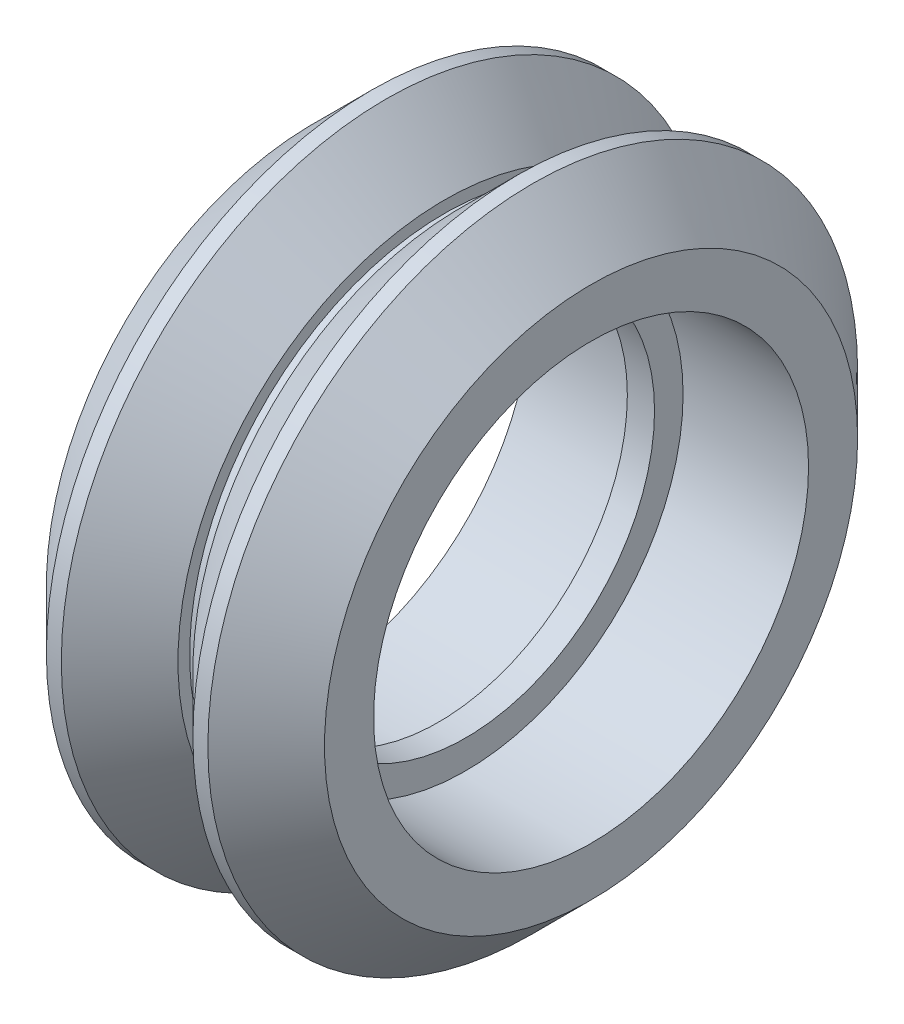
ISO-10303-21;
HEADER;
FILE_DESCRIPTION(('STEP AP214'),'2;1');
FILE_NAME('part.step','',(''),(''),'','','');
FILE_SCHEMA(('AUTOMOTIVE_DESIGN { 1 0 10303 214 1 1 1 1 }'));
ENDSEC;
DATA;
#1=APPLICATION_CONTEXT('core data for automotive mechanical design processes');
#2=APPLICATION_PROTOCOL_DEFINITION('international standard','automotive_design',2000,#1);
#3=PRODUCT_CONTEXT('',#1,'mechanical');
#4=PRODUCT('Part','Part','',(#3));
#5=PRODUCT_RELATED_PRODUCT_CATEGORY('part','',(#4));
#6=PRODUCT_DEFINITION_FORMATION('','',#4);
#7=PRODUCT_DEFINITION_CONTEXT('part definition',#1,'design');
#8=PRODUCT_DEFINITION('design','',#6,#7);
#9=PRODUCT_DEFINITION_SHAPE('','',#8);
#10=(LENGTH_UNIT() NAMED_UNIT(*) SI_UNIT(.MILLI.,.METRE.));
#11=(NAMED_UNIT(*) PLANE_ANGLE_UNIT() SI_UNIT($,.RADIAN.));
#12=(NAMED_UNIT(*) SI_UNIT($,.STERADIAN.) SOLID_ANGLE_UNIT());
#13=UNCERTAINTY_MEASURE_WITH_UNIT(LENGTH_MEASURE(1.E-05),#10,'distance_accuracy_value','');
#14=(GEOMETRIC_REPRESENTATION_CONTEXT(3) GLOBAL_UNCERTAINTY_ASSIGNED_CONTEXT((#13)) GLOBAL_UNIT_ASSIGNED_CONTEXT((#10,
#11,#12)) REPRESENTATION_CONTEXT('',''));
#15=CARTESIAN_POINT('',(0.,0.,0.));
#16=DIRECTION('',(0.,0.,1.));
#17=DIRECTION('',(1.,0.,0.));
#18=AXIS2_PLACEMENT_3D('',#15,#16,#17);
#19=CARTESIAN_POINT('',(-0.499999999999999,6.95,0.));
#20=DIRECTION('',(-1.,0.,0.));
#21=DIRECTION('',(0.,0.,1.));
#22=AXIS2_PLACEMENT_3D('',#19,#20,#21);
#23=PLANE('',#22);
#24=CARTESIAN_POINT('',(-0.499999999999999,0.,0.));
#25=DIRECTION('',(1.,0.,0.));
#26=DIRECTION('',(0.,0.,-1.));
#27=AXIS2_PLACEMENT_3D('',#24,#25,#26);
#28=CIRCLE('',#27,6.95);
#29=CARTESIAN_POINT('',(-0.499999999999999,0.,-6.95));
#30=VERTEX_POINT('',#29);
#31=EDGE_CURVE('E10',#30,#30,#28,.T.);
#32=ORIENTED_EDGE('',*,*,#31,.T.);
#33=EDGE_LOOP('',(#32));
#34=FACE_BOUND('',#33,.T.);
#35=CARTESIAN_POINT('',(-0.499999999999999,0.,0.));
#36=DIRECTION('',(1.,0.,0.));
#37=DIRECTION('',(0.,0.,-1.));
#38=AXIS2_PLACEMENT_3D('',#35,#36,#37);
#39=CIRCLE('',#38,8.);
#40=CARTESIAN_POINT('',(-0.499999999999999,0.,-8.));
#41=VERTEX_POINT('',#40);
#42=EDGE_CURVE('E89',#41,#41,#39,.T.);
#43=ORIENTED_EDGE('',*,*,#42,.F.);
#44=EDGE_LOOP('',(#43));
#45=FACE_BOUND('',#44,.T.);
#46=ADVANCED_FACE('F37',(#34,#45),#23,.T.);
#47=CARTESIAN_POINT('',(0.,0.,0.));
#48=DIRECTION('',(1.,0.,0.));
#49=DIRECTION('',(0.,0.,-1.));
#50=AXIS2_PLACEMENT_3D('',#47,#48,#49);
#51=CYLINDRICAL_SURFACE('',#50,6.95);
#52=CARTESIAN_POINT('',(0.500000000000001,0.,0.));
#53=DIRECTION('',(1.,0.,0.));
#54=DIRECTION('',(0.,0.,-1.));
#55=AXIS2_PLACEMENT_3D('',#52,#53,#54);
#56=CIRCLE('',#55,6.95);
#57=CARTESIAN_POINT('',(0.500000000000001,0.,-6.95));
#58=VERTEX_POINT('',#57);
#59=EDGE_CURVE('E43',#58,#58,#56,.T.);
#60=ORIENTED_EDGE('',*,*,#59,.T.);
#61=EDGE_LOOP('',(#60));
#62=FACE_BOUND('',#61,.T.);
#63=ORIENTED_EDGE('',*,*,#31,.F.);
#64=EDGE_LOOP('',(#63));
#65=FACE_BOUND('',#64,.T.);
#66=ADVANCED_FACE('F97',(#62,#65),#51,.F.);
#67=CARTESIAN_POINT('',(0.500000000000001,6.95,0.));
#68=DIRECTION('',(1.,0.,0.));
#69=DIRECTION('',(0.,0.,-1.));
#70=AXIS2_PLACEMENT_3D('',#67,#68,#69);
#71=PLANE('',#70);
#72=CARTESIAN_POINT('',(0.5,0.,0.));
#73=DIRECTION('',(1.,0.,0.));
#74=DIRECTION('',(0.,0.,-1.));
#75=AXIS2_PLACEMENT_3D('',#72,#73,#74);
#76=CIRCLE('',#75,8.);
#77=CARTESIAN_POINT('',(0.5,0.,-8.));
#78=VERTEX_POINT('',#77);
#79=EDGE_CURVE('E47',#78,#78,#76,.T.);
#80=ORIENTED_EDGE('',*,*,#79,.T.);
#81=EDGE_LOOP('',(#80));
#82=FACE_BOUND('',#81,.T.);
#83=ORIENTED_EDGE('',*,*,#59,.F.);
#84=EDGE_LOOP('',(#83));
#85=FACE_BOUND('',#84,.T.);
#86=ADVANCED_FACE('F101',(#82,#85),#71,.T.);
#87=CARTESIAN_POINT('',(0.,0.,0.));
#88=DIRECTION('',(1.,0.,0.));
#89=DIRECTION('',(0.,0.,-1.));
#90=AXIS2_PLACEMENT_3D('',#87,#88,#89);
#91=CYLINDRICAL_SURFACE('',#90,8.);
#92=CARTESIAN_POINT('',(5.115,0.,0.));
#93=DIRECTION('',(1.,0.,0.));
#94=DIRECTION('',(0.,0.,-1.));
#95=AXIS2_PLACEMENT_3D('',#92,#93,#94);
#96=CIRCLE('',#95,8.);
#97=CARTESIAN_POINT('',(5.115,0.,-8.));
#98=VERTEX_POINT('',#97);
#99=EDGE_CURVE('E51',#98,#98,#96,.T.);
#100=ORIENTED_EDGE('',*,*,#99,.T.);
#101=EDGE_LOOP('',(#100));
#102=FACE_BOUND('',#101,.T.);
#103=ORIENTED_EDGE('',*,*,#79,.F.);
#104=EDGE_LOOP('',(#103));
#105=FACE_BOUND('',#104,.T.);
#106=ADVANCED_FACE('F105',(#102,#105),#91,.F.);
#107=CARTESIAN_POINT('',(5.115,8.,0.));
#108=DIRECTION('',(1.,0.,0.));
#109=DIRECTION('',(0.,0.,-1.));
#110=AXIS2_PLACEMENT_3D('',#107,#108,#109);
#111=PLANE('',#110);
#112=CARTESIAN_POINT('',(5.115,0.,0.));
#113=DIRECTION('',(1.,0.,0.));
#114=DIRECTION('',(0.,0.,-1.));
#115=AXIS2_PLACEMENT_3D('',#112,#113,#114);
#116=CIRCLE('',#115,9.805);
#117=CARTESIAN_POINT('',(5.115,0.,-9.805));
#118=VERTEX_POINT('',#117);
#119=EDGE_CURVE('E56',#118,#118,#116,.T.);
#120=ORIENTED_EDGE('',*,*,#119,.T.);
#121=EDGE_LOOP('',(#120));
#122=FACE_BOUND('',#121,.T.);
#123=ORIENTED_EDGE('',*,*,#99,.F.);
#124=EDGE_LOOP('',(#123));
#125=FACE_BOUND('',#124,.T.);
#126=ADVANCED_FACE('F112',(#122,#125),#111,.T.);
#127=CARTESIAN_POINT('',(5.115,0.,0.));
#128=DIRECTION('',(-1.,0.,0.));
#129=DIRECTION('',(0.,0.,1.));
#130=AXIS2_PLACEMENT_3D('',#127,#128,#129);
#131=CONICAL_SURFACE('',#130,9.805,0.785398163397447);
#132=CARTESIAN_POINT('',(2.96999999999999,0.,0.));
#133=DIRECTION('',(1.,0.,0.));
#134=DIRECTION('',(0.,0.,-1.));
#135=AXIS2_PLACEMENT_3D('',#132,#133,#134);
#136=CIRCLE('',#135,11.95);
#137=CARTESIAN_POINT('',(2.96999999999999,0.,-11.95));
#138=VERTEX_POINT('',#137);
#139=EDGE_CURVE('E59',#138,#138,#136,.T.);
#140=ORIENTED_EDGE('',*,*,#139,.T.);
#141=EDGE_LOOP('',(#140));
#142=FACE_BOUND('',#141,.T.);
#143=ORIENTED_EDGE('',*,*,#119,.F.);
#144=EDGE_LOOP('',(#143));
#145=FACE_BOUND('',#144,.T.);
#146=ADVANCED_FACE('F116',(#142,#145),#131,.T.);
#147=CARTESIAN_POINT('',(0.,0.,0.));
#148=DIRECTION('',(1.,0.,0.));
#149=DIRECTION('',(0.,0.,-1.));
#150=AXIS2_PLACEMENT_3D('',#147,#148,#149);
#151=CYLINDRICAL_SURFACE('',#150,11.95);
#152=CARTESIAN_POINT('',(2.41999999999999,0.,0.));
#153=DIRECTION('',(1.,0.,0.));
#154=DIRECTION('',(0.,0.,-1.));
#155=AXIS2_PLACEMENT_3D('',#152,#153,#154);
#156=CIRCLE('',#155,11.95);
#157=CARTESIAN_POINT('',(2.41999999999999,0.,-11.95));
#158=VERTEX_POINT('',#157);
#159=EDGE_CURVE('E62',#158,#158,#156,.T.);
#160=ORIENTED_EDGE('',*,*,#159,.T.);
#161=EDGE_LOOP('',(#160));
#162=FACE_BOUND('',#161,.T.);
#163=ORIENTED_EDGE('',*,*,#139,.F.);
#164=EDGE_LOOP('',(#163));
#165=FACE_BOUND('',#164,.T.);
#166=ADVANCED_FACE('F120',(#162,#165),#151,.T.);
#167=CARTESIAN_POINT('',(2.41999999999999,0.,0.));
#168=DIRECTION('',(1.,0.,0.));
#169=DIRECTION('',(0.,0.,-1.));
#170=AXIS2_PLACEMENT_3D('',#167,#168,#169);
#171=CONICAL_SURFACE('',#170,11.95,0.785398163397449);
#172=CARTESIAN_POINT('',(0.274999999999998,0.,0.));
#173=DIRECTION('',(1.,0.,0.));
#174=DIRECTION('',(0.,0.,-1.));
#175=AXIS2_PLACEMENT_3D('',#172,#173,#174);
#176=CIRCLE('',#175,9.805);
#177=CARTESIAN_POINT('',(0.274999999999998,0.,-9.805));
#178=VERTEX_POINT('',#177);
#179=EDGE_CURVE('E65',#178,#178,#176,.T.);
#180=ORIENTED_EDGE('',*,*,#179,.T.);
#181=EDGE_LOOP('',(#180));
#182=FACE_BOUND('',#181,.T.);
#183=ORIENTED_EDGE('',*,*,#159,.F.);
#184=EDGE_LOOP('',(#183));
#185=FACE_BOUND('',#184,.T.);
#186=ADVANCED_FACE('F124',(#182,#185),#171,.T.);
#187=CARTESIAN_POINT('',(0.275,9.805,0.));
#188=DIRECTION('',(-1.,0.,0.));
#189=DIRECTION('',(0.,0.,1.));
#190=AXIS2_PLACEMENT_3D('',#187,#188,#189);
#191=PLANE('',#190);
#192=CARTESIAN_POINT('',(0.275000000000003,0.,0.));
#193=DIRECTION('',(1.,0.,0.));
#194=DIRECTION('',(0.,0.,-1.));
#195=AXIS2_PLACEMENT_3D('',#192,#193,#194);
#196=CIRCLE('',#195,9.375);
#197=CARTESIAN_POINT('',(0.275000000000003,0.,-9.375));
#198=VERTEX_POINT('',#197);
#199=EDGE_CURVE('E68',#198,#198,#196,.T.);
#200=ORIENTED_EDGE('',*,*,#199,.T.);
#201=EDGE_LOOP('',(#200));
#202=FACE_BOUND('',#201,.T.);
#203=ORIENTED_EDGE('',*,*,#179,.F.);
#204=EDGE_LOOP('',(#203));
#205=FACE_BOUND('',#204,.T.);
#206=ADVANCED_FACE('F128',(#202,#205),#191,.T.);
#207=CARTESIAN_POINT('',(0.,0.,0.));
#208=DIRECTION('',(1.,0.,0.));
#209=DIRECTION('',(0.,0.,-1.));
#210=AXIS2_PLACEMENT_3D('',#207,#208,#209);
#211=CYLINDRICAL_SURFACE('',#210,9.375);
#212=CARTESIAN_POINT('',(-0.274999999999998,0.,0.));
#213=DIRECTION('',(1.,0.,0.));
#214=DIRECTION('',(0.,0.,-1.));
#215=AXIS2_PLACEMENT_3D('',#212,#213,#214);
#216=CIRCLE('',#215,9.375);
#217=CARTESIAN_POINT('',(-0.274999999999998,0.,-9.375));
#218=VERTEX_POINT('',#217);
#219=EDGE_CURVE('E71',#218,#218,#216,.T.);
#220=ORIENTED_EDGE('',*,*,#219,.T.);
#221=EDGE_LOOP('',(#220));
#222=FACE_BOUND('',#221,.T.);
#223=ORIENTED_EDGE('',*,*,#199,.F.);
#224=EDGE_LOOP('',(#223));
#225=FACE_BOUND('',#224,.T.);
#226=ADVANCED_FACE('F132',(#222,#225),#211,.T.);
#227=CARTESIAN_POINT('',(-0.274999999999998,9.805,0.));
#228=DIRECTION('',(1.,0.,0.));
#229=DIRECTION('',(0.,0.,-1.));
#230=AXIS2_PLACEMENT_3D('',#227,#228,#229);
#231=PLANE('',#230);
#232=CARTESIAN_POINT('',(-0.274999999999998,0.,0.));
#233=DIRECTION('',(1.,0.,0.));
#234=DIRECTION('',(0.,0.,-1.));
#235=AXIS2_PLACEMENT_3D('',#232,#233,#234);
#236=CIRCLE('',#235,9.805);
#237=CARTESIAN_POINT('',(-0.274999999999998,0.,-9.805));
#238=VERTEX_POINT('',#237);
#239=EDGE_CURVE('E74',#238,#238,#236,.T.);
#240=ORIENTED_EDGE('',*,*,#239,.T.);
#241=EDGE_LOOP('',(#240));
#242=FACE_BOUND('',#241,.T.);
#243=ORIENTED_EDGE('',*,*,#219,.F.);
#244=EDGE_LOOP('',(#243));
#245=FACE_BOUND('',#244,.T.);
#246=ADVANCED_FACE('F136',(#242,#245),#231,.T.);
#247=CARTESIAN_POINT('',(-0.274999999999998,0.,0.));
#248=DIRECTION('',(-1.,0.,0.));
#249=DIRECTION('',(0.,0.,1.));
#250=AXIS2_PLACEMENT_3D('',#247,#248,#249);
#251=CONICAL_SURFACE('',#250,9.805,0.785398163397449);
#252=CARTESIAN_POINT('',(-2.41999999999999,0.,0.));
#253=DIRECTION('',(1.,0.,0.));
#254=DIRECTION('',(0.,0.,-1.));
#255=AXIS2_PLACEMENT_3D('',#252,#253,#254);
#256=CIRCLE('',#255,11.95);
#257=CARTESIAN_POINT('',(-2.41999999999999,0.,-11.95));
#258=VERTEX_POINT('',#257);
#259=EDGE_CURVE('E77',#258,#258,#256,.T.);
#260=ORIENTED_EDGE('',*,*,#259,.T.);
#261=EDGE_LOOP('',(#260));
#262=FACE_BOUND('',#261,.T.);
#263=ORIENTED_EDGE('',*,*,#239,.F.);
#264=EDGE_LOOP('',(#263));
#265=FACE_BOUND('',#264,.T.);
#266=ADVANCED_FACE('F140',(#262,#265),#251,.T.);
#267=CARTESIAN_POINT('',(0.,0.,0.));
#268=DIRECTION('',(1.,0.,0.));
#269=DIRECTION('',(0.,0.,-1.));
#270=AXIS2_PLACEMENT_3D('',#267,#268,#269);
#271=CYLINDRICAL_SURFACE('',#270,11.95);
#272=CARTESIAN_POINT('',(-2.96999999999999,0.,0.));
#273=DIRECTION('',(1.,0.,0.));
#274=DIRECTION('',(0.,0.,-1.));
#275=AXIS2_PLACEMENT_3D('',#272,#273,#274);
#276=CIRCLE('',#275,11.95);
#277=CARTESIAN_POINT('',(-2.96999999999999,0.,-11.95));
#278=VERTEX_POINT('',#277);
#279=EDGE_CURVE('E80',#278,#278,#276,.T.);
#280=ORIENTED_EDGE('',*,*,#279,.T.);
#281=EDGE_LOOP('',(#280));
#282=FACE_BOUND('',#281,.T.);
#283=ORIENTED_EDGE('',*,*,#259,.F.);
#284=EDGE_LOOP('',(#283));
#285=FACE_BOUND('',#284,.T.);
#286=ADVANCED_FACE('F144',(#282,#285),#271,.T.);
#287=CARTESIAN_POINT('',(-2.96999999999999,0.,0.));
#288=DIRECTION('',(1.,0.,0.));
#289=DIRECTION('',(0.,0.,-1.));
#290=AXIS2_PLACEMENT_3D('',#287,#288,#289);
#291=CONICAL_SURFACE('',#290,11.95,0.785398163397447);
#292=CARTESIAN_POINT('',(-5.115,0.,0.));
#293=DIRECTION('',(1.,0.,0.));
#294=DIRECTION('',(0.,0.,-1.));
#295=AXIS2_PLACEMENT_3D('',#292,#293,#294);
#296=CIRCLE('',#295,9.805);
#297=CARTESIAN_POINT('',(-5.115,0.,-9.805));
#298=VERTEX_POINT('',#297);
#299=EDGE_CURVE('E83',#298,#298,#296,.T.);
#300=ORIENTED_EDGE('',*,*,#299,.T.);
#301=EDGE_LOOP('',(#300));
#302=FACE_BOUND('',#301,.T.);
#303=ORIENTED_EDGE('',*,*,#279,.F.);
#304=EDGE_LOOP('',(#303));
#305=FACE_BOUND('',#304,.T.);
#306=ADVANCED_FACE('F148',(#302,#305),#291,.T.);
#307=CARTESIAN_POINT('',(-5.115,8.,0.));
#308=DIRECTION('',(-1.,0.,0.));
#309=DIRECTION('',(0.,0.,1.));
#310=AXIS2_PLACEMENT_3D('',#307,#308,#309);
#311=PLANE('',#310);
#312=CARTESIAN_POINT('',(-5.115,0.,0.));
#313=DIRECTION('',(1.,0.,0.));
#314=DIRECTION('',(0.,0.,-1.));
#315=AXIS2_PLACEMENT_3D('',#312,#313,#314);
#316=CIRCLE('',#315,8.);
#317=CARTESIAN_POINT('',(-5.115,0.,-8.));
#318=VERTEX_POINT('',#317);
#319=EDGE_CURVE('E86',#318,#318,#316,.T.);
#320=ORIENTED_EDGE('',*,*,#319,.T.);
#321=EDGE_LOOP('',(#320));
#322=FACE_BOUND('',#321,.T.);
#323=ORIENTED_EDGE('',*,*,#299,.F.);
#324=EDGE_LOOP('',(#323));
#325=FACE_BOUND('',#324,.T.);
#326=ADVANCED_FACE('F152',(#322,#325),#311,.T.);
#327=CARTESIAN_POINT('',(0.,0.,0.));
#328=DIRECTION('',(1.,0.,0.));
#329=DIRECTION('',(0.,0.,-1.));
#330=AXIS2_PLACEMENT_3D('',#327,#328,#329);
#331=CYLINDRICAL_SURFACE('',#330,8.);
#332=ORIENTED_EDGE('',*,*,#42,.T.);
#333=EDGE_LOOP('',(#332));
#334=FACE_BOUND('',#333,.T.);
#335=ORIENTED_EDGE('',*,*,#319,.F.);
#336=EDGE_LOOP('',(#335));
#337=FACE_BOUND('',#336,.T.);
#338=ADVANCED_FACE('F93',(#334,#337),#331,.F.);
#339=CLOSED_SHELL('',(#46,#66,#86,#106,#126,#146,#166,#186,#206,#226,#246,#266,#286,#306,#326,#338));
#340=MANIFOLD_SOLID_BREP('B2',#339);
#341=ADVANCED_BREP_SHAPE_REPRESENTATION('',(#18,#340),#14);
#342=SHAPE_DEFINITION_REPRESENTATION(#9,#341);
ENDSEC;
END-ISO-10303-21;
